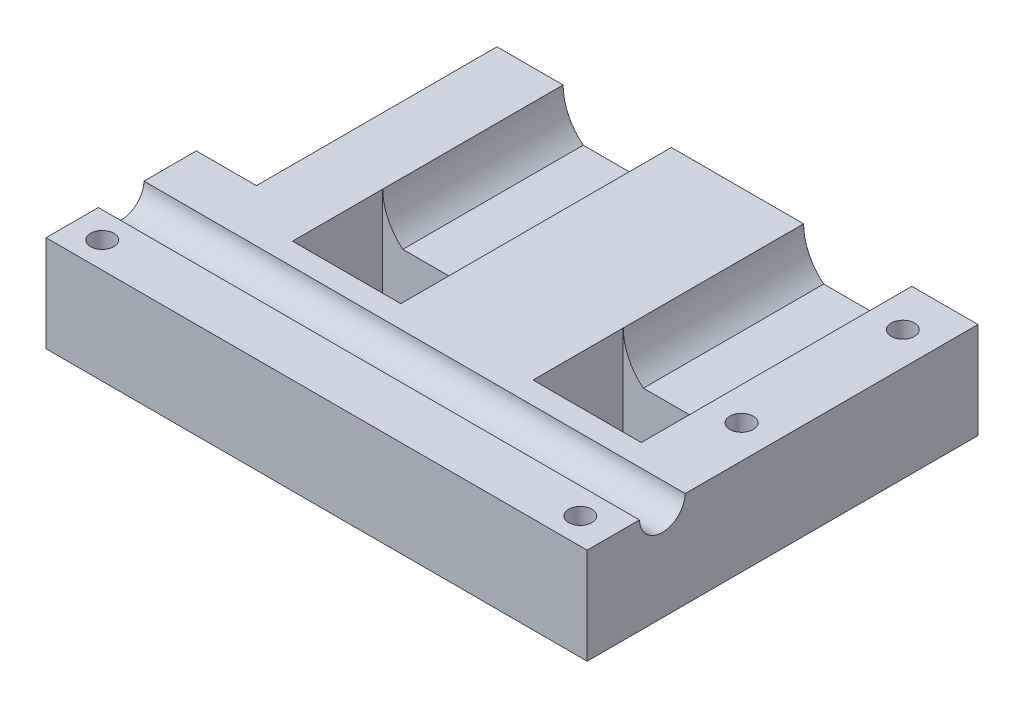
ISO-10303-21;
HEADER;
FILE_DESCRIPTION(('STEP AP214'),'2;1');
FILE_NAME('part.step','',(''),(''),'','','');
FILE_SCHEMA(('AUTOMOTIVE_DESIGN { 1 0 10303 214 1 1 1 1 }'));
ENDSEC;
DATA;
#1=APPLICATION_CONTEXT('core data for automotive mechanical design processes');
#2=APPLICATION_PROTOCOL_DEFINITION('international standard','automotive_design',2000,#1);
#3=PRODUCT_CONTEXT('',#1,'mechanical');
#4=PRODUCT('Part','Part','',(#3));
#5=PRODUCT_RELATED_PRODUCT_CATEGORY('part','',(#4));
#6=PRODUCT_DEFINITION_FORMATION('','',#4);
#7=PRODUCT_DEFINITION_CONTEXT('part definition',#1,'design');
#8=PRODUCT_DEFINITION('design','',#6,#7);
#9=PRODUCT_DEFINITION_SHAPE('','',#8);
#10=(LENGTH_UNIT() NAMED_UNIT(*) SI_UNIT(.MILLI.,.METRE.));
#11=(NAMED_UNIT(*) PLANE_ANGLE_UNIT() SI_UNIT($,.RADIAN.));
#12=(NAMED_UNIT(*) SI_UNIT($,.STERADIAN.) SOLID_ANGLE_UNIT());
#13=UNCERTAINTY_MEASURE_WITH_UNIT(LENGTH_MEASURE(1.E-05),#10,'distance_accuracy_value','');
#14=(GEOMETRIC_REPRESENTATION_CONTEXT(3) GLOBAL_UNCERTAINTY_ASSIGNED_CONTEXT((#13)) GLOBAL_UNIT_ASSIGNED_CONTEXT((#10,
#11,#12)) REPRESENTATION_CONTEXT('',''));
#15=CARTESIAN_POINT('',(0.,0.,0.));
#16=DIRECTION('',(0.,0.,1.));
#17=DIRECTION('',(1.,0.,0.));
#18=AXIS2_PLACEMENT_3D('',#15,#16,#17);
#19=CARTESIAN_POINT('',(-50.8,20.32,38.1));
#20=DIRECTION('',(0.,-1.,0.));
#21=DIRECTION('',(1.,0.,0.));
#22=AXIS2_PLACEMENT_3D('',#19,#20,#21);
#23=PLANE('',#22);
#24=CARTESIAN_POINT('',(43.815,20.32,42.9573321644896));
#25=DIRECTION('',(0.,1.,0.));
#26=DIRECTION('',(0.,0.,1.));
#27=AXIS2_PLACEMENT_3D('',#24,#25,#26);
#28=CIRCLE('',#27,2.45745);
#29=CARTESIAN_POINT('',(43.815,20.32,45.4147821644896));
#30=VERTEX_POINT('',#29);
#31=EDGE_CURVE('E232',#30,#30,#28,.T.);
#32=ORIENTED_EDGE('',*,*,#31,.F.);
#33=EDGE_LOOP('',(#32));
#34=FACE_BOUND('',#33,.T.);
#35=DIRECTION('',(0.,0.,-1.));
#36=VECTOR('',#35,1.);
#37=CARTESIAN_POINT('',(-63.5,20.32,0.));
#38=LINE('',#37,#36);
#39=CARTESIAN_POINT('',(-63.5,20.32,61.8506713420415));
#40=VERTEX_POINT('',#39);
#41=CARTESIAN_POINT('',(-63.5,20.32,50.8));
#42=VERTEX_POINT('',#41);
#43=EDGE_CURVE('E210',#40,#42,#38,.T.);
#44=ORIENTED_EDGE('',*,*,#43,.F.);
#45=DIRECTION('',(-1.,0.,0.));
#46=VECTOR('',#45,1.);
#47=CARTESIAN_POINT('',(64.4499893040251,20.32,61.8506713420415));
#48=LINE('',#47,#46);
#49=CARTESIAN_POINT('',(50.8,20.32,61.8506713420415));
#50=VERTEX_POINT('',#49);
#51=EDGE_CURVE('E55',#40,#50,#48,.F.);
#52=ORIENTED_EDGE('',*,*,#51,.T.);
#53=DIRECTION('',(0.,0.,-1.));
#54=VECTOR('',#53,1.);
#55=CARTESIAN_POINT('',(50.8,20.32,38.1));
#56=LINE('',#55,#54);
#57=CARTESIAN_POINT('',(50.8,20.32,0.));
#58=VERTEX_POINT('',#57);
#59=EDGE_CURVE('E207',#50,#58,#56,.T.);
#60=ORIENTED_EDGE('',*,*,#59,.T.);
#61=DIRECTION('',(-1.,0.,0.));
#62=VECTOR('',#61,1.);
#63=CARTESIAN_POINT('',(50.8,20.32,0.));
#64=LINE('',#63,#62);
#65=CARTESIAN_POINT('',(36.83,20.32,0.));
#66=VERTEX_POINT('',#65);
#67=EDGE_CURVE('E359',#58,#66,#64,.T.);
#68=ORIENTED_EDGE('',*,*,#67,.T.);
#69=DIRECTION('',(0.,0.,-1.));
#70=VECTOR('',#69,1.);
#71=CARTESIAN_POINT('',(36.83,20.32,38.1));
#72=LINE('',#71,#70);
#73=CARTESIAN_POINT('',(36.83,20.32,38.1));
#74=VERTEX_POINT('',#73);
#75=EDGE_CURVE('E216',#74,#66,#72,.T.);
#76=ORIENTED_EDGE('',*,*,#75,.F.);
#77=DIRECTION('',(0.,0.,-1.));
#78=VECTOR('',#77,1.);
#79=CARTESIAN_POINT('',(36.83,20.32,38.1));
#80=LINE('',#79,#78);
#81=CARTESIAN_POINT('',(36.83,20.32,57.15));
#82=VERTEX_POINT('',#81);
#83=EDGE_CURVE('E294',#82,#74,#80,.T.);
#84=ORIENTED_EDGE('',*,*,#83,.F.);
#85=DIRECTION('',(1.,0.,0.));
#86=VECTOR('',#85,1.);
#87=CARTESIAN_POINT('',(36.83,20.32,57.15));
#88=LINE('',#87,#86);
#89=CARTESIAN_POINT('',(13.97,20.32,57.15));
#90=VERTEX_POINT('',#89);
#91=EDGE_CURVE('E291',#90,#82,#88,.T.);
#92=ORIENTED_EDGE('',*,*,#91,.F.);
#93=DIRECTION('',(0.,0.,1.));
#94=VECTOR('',#93,1.);
#95=CARTESIAN_POINT('',(13.97,20.32,38.1));
#96=LINE('',#95,#94);
#97=CARTESIAN_POINT('',(13.97,20.32,38.1));
#98=VERTEX_POINT('',#97);
#99=EDGE_CURVE('E254',#98,#90,#96,.T.);
#100=ORIENTED_EDGE('',*,*,#99,.F.);
#101=DIRECTION('',(0.,0.,-1.));
#102=VECTOR('',#101,1.);
#103=CARTESIAN_POINT('',(13.97,20.32,38.1));
#104=LINE('',#103,#102);
#105=CARTESIAN_POINT('',(13.97,20.32,0.));
#106=VERTEX_POINT('',#105);
#107=EDGE_CURVE('E397',#98,#106,#104,.T.);
#108=ORIENTED_EDGE('',*,*,#107,.T.);
#109=DIRECTION('',(-1.,0.,0.));
#110=VECTOR('',#109,1.);
#111=CARTESIAN_POINT('',(13.97,20.32,0.));
#112=LINE('',#111,#110);
#113=CARTESIAN_POINT('',(-13.97,20.32,0.));
#114=VERTEX_POINT('',#113);
#115=EDGE_CURVE('E367',#106,#114,#112,.T.);
#116=ORIENTED_EDGE('',*,*,#115,.T.);
#117=DIRECTION('',(0.,0.,-1.));
#118=VECTOR('',#117,1.);
#119=CARTESIAN_POINT('',(-13.97,20.32,38.1));
#120=LINE('',#119,#118);
#121=CARTESIAN_POINT('',(-13.97,20.32,38.1));
#122=VERTEX_POINT('',#121);
#123=EDGE_CURVE('E394',#122,#114,#120,.T.);
#124=ORIENTED_EDGE('',*,*,#123,.F.);
#125=DIRECTION('',(0.,0.,-1.));
#126=VECTOR('',#125,1.);
#127=CARTESIAN_POINT('',(-13.97,20.32,38.1));
#128=LINE('',#127,#126);
#129=CARTESIAN_POINT('',(-13.97,20.32,57.15));
#130=VERTEX_POINT('',#129);
#131=EDGE_CURVE('E269',#130,#122,#128,.T.);
#132=ORIENTED_EDGE('',*,*,#131,.F.);
#133=DIRECTION('',(1.,0.,0.));
#134=VECTOR('',#133,1.);
#135=CARTESIAN_POINT('',(-36.83,20.32,57.15));
#136=LINE('',#135,#134);
#137=CARTESIAN_POINT('',(-36.83,20.32,57.15));
#138=VERTEX_POINT('',#137);
#139=EDGE_CURVE('E265',#138,#130,#136,.T.);
#140=ORIENTED_EDGE('',*,*,#139,.F.);
#141=DIRECTION('',(0.,0.,1.));
#142=VECTOR('',#141,1.);
#143=CARTESIAN_POINT('',(-36.83,20.32,38.1));
#144=LINE('',#143,#142);
#145=CARTESIAN_POINT('',(-36.83,20.32,38.1));
#146=VERTEX_POINT('',#145);
#147=EDGE_CURVE('E63',#146,#138,#144,.T.);
#148=ORIENTED_EDGE('',*,*,#147,.F.);
#149=DIRECTION('',(0.,0.,-1.));
#150=VECTOR('',#149,1.);
#151=CARTESIAN_POINT('',(-36.83,20.32,38.1));
#152=LINE('',#151,#150);
#153=CARTESIAN_POINT('',(-36.83,20.32,0.));
#154=VERTEX_POINT('',#153);
#155=EDGE_CURVE('E385',#146,#154,#152,.T.);
#156=ORIENTED_EDGE('',*,*,#155,.T.);
#157=DIRECTION('',(-1.,0.,0.));
#158=VECTOR('',#157,1.);
#159=CARTESIAN_POINT('',(-50.8,20.32,0.));
#160=LINE('',#159,#158);
#161=CARTESIAN_POINT('',(-50.8,20.32,0.));
#162=VERTEX_POINT('',#161);
#163=EDGE_CURVE('E375',#154,#162,#160,.T.);
#164=ORIENTED_EDGE('',*,*,#163,.T.);
#165=DIRECTION('',(0.,0.,-1.));
#166=VECTOR('',#165,1.);
#167=CARTESIAN_POINT('',(-50.8,20.32,38.1));
#168=LINE('',#167,#166);
#169=CARTESIAN_POINT('',(-50.8,20.32,50.8));
#170=VERTEX_POINT('',#169);
#171=EDGE_CURVE('E383',#170,#162,#168,.T.);
#172=ORIENTED_EDGE('',*,*,#171,.F.);
#173=DIRECTION('',(1.,0.,0.));
#174=VECTOR('',#173,1.);
#175=CARTESIAN_POINT('',(-63.5,20.32,50.8));
#176=LINE('',#175,#174);
#177=EDGE_CURVE('E324',#42,#170,#176,.T.);
#178=ORIENTED_EDGE('',*,*,#177,.F.);
#179=EDGE_LOOP('',(#44,#52,#60,#68,#76,#84,#92,#100,#108,#116,#124,#132,#140,#148,#156,#164,
#172,#178));
#180=FACE_BOUND('',#179,.T.);
#181=CARTESIAN_POINT('',(43.815,20.32,8.89));
#182=DIRECTION('',(0.,1.,0.));
#183=DIRECTION('',(0.,0.,1.));
#184=AXIS2_PLACEMENT_3D('',#181,#182,#183);
#185=CIRCLE('',#184,2.45745);
#186=CARTESIAN_POINT('',(43.815,20.32,11.34745));
#187=VERTEX_POINT('',#186);
#188=EDGE_CURVE('E246',#187,#187,#185,.T.);
#189=ORIENTED_EDGE('',*,*,#188,.F.);
#190=EDGE_LOOP('',(#189));
#191=FACE_BOUND('',#190,.T.);
#192=ADVANCED_FACE('F39',(#34,#180,#191),#23,.F.);
#193=CARTESIAN_POINT('',(43.815,20.32,77.0246643289793));
#194=DIRECTION('',(0.,1.,0.));
#195=DIRECTION('',(0.,0.,1.));
#196=AXIS2_PLACEMENT_3D('',#193,#194,#195);
#197=CIRCLE('',#196,2.45745);
#198=CARTESIAN_POINT('',(43.815,20.32,79.4821143289793));
#199=VERTEX_POINT('',#198);
#200=EDGE_CURVE('E830',#199,#199,#197,.T.);
#201=ORIENTED_EDGE('',*,*,#200,.F.);
#202=EDGE_LOOP('',(#201));
#203=FACE_BOUND('',#202,.T.);
#204=CARTESIAN_POINT('',(-57.15,20.32,77.0246643289793));
#205=DIRECTION('',(0.,1.,0.));
#206=DIRECTION('',(0.,0.,1.));
#207=AXIS2_PLACEMENT_3D('',#204,#205,#206);
#208=CIRCLE('',#207,2.45745);
#209=CARTESIAN_POINT('',(-57.15,20.32,79.4821143289793));
#210=VERTEX_POINT('',#209);
#211=EDGE_CURVE('E240',#210,#210,#208,.T.);
#212=ORIENTED_EDGE('',*,*,#211,.F.);
#213=EDGE_LOOP('',(#212));
#214=FACE_BOUND('',#213,.T.);
#215=CARTESIAN_POINT('',(50.8,20.32,82.55));
#216=VERTEX_POINT('',#215);
#217=CARTESIAN_POINT('',(50.8,20.32,71.4993286579585));
#218=VERTEX_POINT('',#217);
#219=EDGE_CURVE('E48',#216,#218,#56,.T.);
#220=ORIENTED_EDGE('',*,*,#219,.T.);
#221=DIRECTION('',(-1.,0.,0.));
#222=VECTOR('',#221,1.);
#223=CARTESIAN_POINT('',(64.4499893040251,20.32,71.4993286579585));
#224=LINE('',#223,#222);
#225=CARTESIAN_POINT('',(-63.5,20.32,71.4993286579585));
#226=VERTEX_POINT('',#225);
#227=EDGE_CURVE('E198',#218,#226,#224,.T.);
#228=ORIENTED_EDGE('',*,*,#227,.T.);
#229=CARTESIAN_POINT('',(-63.5,20.32,82.55));
#230=VERTEX_POINT('',#229);
#231=EDGE_CURVE('E321',#230,#226,#38,.T.);
#232=ORIENTED_EDGE('',*,*,#231,.F.);
#233=DIRECTION('',(-1.,0.,0.));
#234=VECTOR('',#233,1.);
#235=CARTESIAN_POINT('',(-50.8,20.32,82.55));
#236=LINE('',#235,#234);
#237=EDGE_CURVE('E341',#216,#230,#236,.T.);
#238=ORIENTED_EDGE('',*,*,#237,.F.);
#239=EDGE_LOOP('',(#220,#228,#232,#238));
#240=FACE_BOUND('',#239,.T.);
#241=ADVANCED_FACE('F449',(#203,#214,#240),#23,.F.);
#242=CARTESIAN_POINT('',(50.8,0.,38.1));
#243=DIRECTION('',(-1.,0.,0.));
#244=DIRECTION('',(0.,-1.,0.));
#245=AXIS2_PLACEMENT_3D('',#242,#243,#244);
#246=PLANE('',#245);
#247=ORIENTED_EDGE('',*,*,#59,.F.);
#248=CARTESIAN_POINT('',(50.8,20.447,66.675));
#249=DIRECTION('',(-1.,0.,0.));
#250=DIRECTION('',(0.,-1.,0.));
#251=AXIS2_PLACEMENT_3D('',#248,#249,#250);
#252=CIRCLE('',#251,4.826);
#253=EDGE_CURVE('E195',#218,#50,#252,.F.);
#254=ORIENTED_EDGE('',*,*,#253,.F.);
#255=ORIENTED_EDGE('',*,*,#219,.F.);
#256=DIRECTION('',(0.,1.,0.));
#257=VECTOR('',#256,1.);
#258=CARTESIAN_POINT('',(50.8,20.32,82.55));
#259=LINE('',#258,#257);
#260=CARTESIAN_POINT('',(50.8,0.,82.55));
#261=VERTEX_POINT('',#260);
#262=EDGE_CURVE('E338',#261,#216,#259,.T.);
#263=ORIENTED_EDGE('',*,*,#262,.F.);
#264=DIRECTION('',(0.,0.,-1.));
#265=VECTOR('',#264,1.);
#266=CARTESIAN_POINT('',(50.8,0.,38.1));
#267=LINE('',#266,#265);
#268=CARTESIAN_POINT('',(50.8,0.,0.));
#269=VERTEX_POINT('',#268);
#270=EDGE_CURVE('E357',#261,#269,#267,.T.);
#271=ORIENTED_EDGE('',*,*,#270,.T.);
#272=DIRECTION('',(0.,1.,0.));
#273=VECTOR('',#272,1.);
#274=CARTESIAN_POINT('',(50.8,0.,0.));
#275=LINE('',#274,#273);
#276=EDGE_CURVE('E215',#269,#58,#275,.T.);
#277=ORIENTED_EDGE('',*,*,#276,.T.);
#278=EDGE_LOOP('',(#247,#254,#255,#263,#271,#277));
#279=FACE_BOUND('',#278,.T.);
#280=ADVANCED_FACE('F41',(#279),#246,.F.);
#281=CARTESIAN_POINT('',(25.4,20.32,38.1));
#282=DIRECTION('',(0.,0.,-1.));
#283=DIRECTION('',(-1.,0.,0.));
#284=AXIS2_PLACEMENT_3D('',#281,#282,#283);
#285=CYLINDRICAL_SURFACE('',#284,11.43);
#286=CARTESIAN_POINT('',(25.4,20.32,0.));
#287=DIRECTION('',(0.,0.,-1.));
#288=DIRECTION('',(1.,0.,0.));
#289=AXIS2_PLACEMENT_3D('',#286,#287,#288);
#290=CIRCLE('',#289,11.43);
#291=CARTESIAN_POINT('',(32.5842048968553,11.43,0.));
#292=VERTEX_POINT('',#291);
#293=EDGE_CURVE('E361',#66,#292,#290,.T.);
#294=ORIENTED_EDGE('',*,*,#293,.T.);
#295=DIRECTION('',(0.,0.,-1.));
#296=VECTOR('',#295,1.);
#297=CARTESIAN_POINT('',(32.5842048968553,11.43,38.1));
#298=LINE('',#297,#296);
#299=CARTESIAN_POINT('',(32.5842048968553,11.43,38.1));
#300=VERTEX_POINT('',#299);
#301=EDGE_CURVE('E219',#300,#292,#298,.T.);
#302=ORIENTED_EDGE('',*,*,#301,.F.);
#303=CARTESIAN_POINT('',(25.4,20.32,38.1));
#304=DIRECTION('',(0.,0.,-1.));
#305=DIRECTION('',(1.,0.,0.));
#306=AXIS2_PLACEMENT_3D('',#303,#304,#305);
#307=CIRCLE('',#306,11.43);
#308=EDGE_CURVE('E343',#74,#300,#307,.T.);
#309=ORIENTED_EDGE('',*,*,#308,.F.);
#310=ORIENTED_EDGE('',*,*,#75,.T.);
#311=EDGE_LOOP('',(#294,#302,#309,#310));
#312=FACE_BOUND('',#311,.T.);
#313=ADVANCED_FACE('F433',(#312),#285,.F.);
#314=CARTESIAN_POINT('',(32.5842048968553,11.43,38.1));
#315=DIRECTION('',(0.,-1.,0.));
#316=DIRECTION('',(1.,0.,0.));
#317=AXIS2_PLACEMENT_3D('',#314,#315,#316);
#318=PLANE('',#317);
#319=DIRECTION('',(-1.,0.,0.));
#320=VECTOR('',#319,1.);
#321=CARTESIAN_POINT('',(32.5842048968553,11.43,0.));
#322=LINE('',#321,#320);
#323=CARTESIAN_POINT('',(18.2157951031447,11.43,0.));
#324=VERTEX_POINT('',#323);
#325=EDGE_CURVE('E363',#292,#324,#322,.T.);
#326=ORIENTED_EDGE('',*,*,#325,.T.);
#327=DIRECTION('',(0.,0.,-1.));
#328=VECTOR('',#327,1.);
#329=CARTESIAN_POINT('',(18.2157951031447,11.43,38.1));
#330=LINE('',#329,#328);
#331=CARTESIAN_POINT('',(18.2157951031447,11.43,38.1));
#332=VERTEX_POINT('',#331);
#333=EDGE_CURVE('E400',#332,#324,#330,.T.);
#334=ORIENTED_EDGE('',*,*,#333,.F.);
#335=DIRECTION('',(-1.,0.,0.));
#336=VECTOR('',#335,1.);
#337=CARTESIAN_POINT('',(32.5842048968553,11.43,38.1));
#338=LINE('',#337,#336);
#339=EDGE_CURVE('E345',#300,#332,#338,.T.);
#340=ORIENTED_EDGE('',*,*,#339,.F.);
#341=ORIENTED_EDGE('',*,*,#301,.T.);
#342=EDGE_LOOP('',(#326,#334,#340,#341));
#343=FACE_BOUND('',#342,.T.);
#344=ADVANCED_FACE('F407',(#343),#318,.F.);
#345=CARTESIAN_POINT('',(25.4,20.32,38.1));
#346=DIRECTION('',(0.,0.,-1.));
#347=DIRECTION('',(-1.,0.,0.));
#348=AXIS2_PLACEMENT_3D('',#345,#346,#347);
#349=CYLINDRICAL_SURFACE('',#348,11.43);
#350=CARTESIAN_POINT('',(25.4,20.32,0.));
#351=DIRECTION('',(0.,0.,-1.));
#352=DIRECTION('',(1.,0.,0.));
#353=AXIS2_PLACEMENT_3D('',#350,#351,#352);
#354=CIRCLE('',#353,11.43);
#355=EDGE_CURVE('E365',#324,#106,#354,.T.);
#356=ORIENTED_EDGE('',*,*,#355,.T.);
#357=ORIENTED_EDGE('',*,*,#107,.F.);
#358=CARTESIAN_POINT('',(25.4,20.32,38.1));
#359=DIRECTION('',(0.,0.,-1.));
#360=DIRECTION('',(1.,0.,0.));
#361=AXIS2_PLACEMENT_3D('',#358,#359,#360);
#362=CIRCLE('',#361,11.43);
#363=EDGE_CURVE('E348',#332,#98,#362,.T.);
#364=ORIENTED_EDGE('',*,*,#363,.F.);
#365=ORIENTED_EDGE('',*,*,#333,.T.);
#366=EDGE_LOOP('',(#356,#357,#364,#365));
#367=FACE_BOUND('',#366,.T.);
#368=ADVANCED_FACE('F419',(#367),#349,.F.);
#369=CARTESIAN_POINT('',(-25.4,20.32,38.1));
#370=DIRECTION('',(0.,0.,-1.));
#371=DIRECTION('',(-1.,0.,0.));
#372=AXIS2_PLACEMENT_3D('',#369,#370,#371);
#373=CYLINDRICAL_SURFACE('',#372,11.43);
#374=CARTESIAN_POINT('',(-25.4,20.32,0.));
#375=DIRECTION('',(0.,0.,-1.));
#376=DIRECTION('',(-1.,0.,0.));
#377=AXIS2_PLACEMENT_3D('',#374,#375,#376);
#378=CIRCLE('',#377,11.43);
#379=CARTESIAN_POINT('',(-18.2157951031447,11.43,0.));
#380=VERTEX_POINT('',#379);
#381=EDGE_CURVE('E369',#114,#380,#378,.T.);
#382=ORIENTED_EDGE('',*,*,#381,.T.);
#383=DIRECTION('',(0.,0.,-1.));
#384=VECTOR('',#383,1.);
#385=CARTESIAN_POINT('',(-18.2157951031447,11.43,38.1));
#386=LINE('',#385,#384);
#387=CARTESIAN_POINT('',(-18.2157951031447,11.43,38.1));
#388=VERTEX_POINT('',#387);
#389=EDGE_CURVE('E391',#388,#380,#386,.T.);
#390=ORIENTED_EDGE('',*,*,#389,.F.);
#391=CARTESIAN_POINT('',(-25.4,20.32,38.1));
#392=DIRECTION('',(0.,0.,-1.));
#393=DIRECTION('',(-1.,0.,0.));
#394=AXIS2_PLACEMENT_3D('',#391,#392,#393);
#395=CIRCLE('',#394,11.43);
#396=EDGE_CURVE('E351',#122,#388,#395,.T.);
#397=ORIENTED_EDGE('',*,*,#396,.F.);
#398=ORIENTED_EDGE('',*,*,#123,.T.);
#399=EDGE_LOOP('',(#382,#390,#397,#398));
#400=FACE_BOUND('',#399,.T.);
#401=ADVANCED_FACE('F474',(#400),#373,.F.);
#402=CARTESIAN_POINT('',(-32.5842048968553,11.43,38.1));
#403=DIRECTION('',(0.,-1.,0.));
#404=DIRECTION('',(1.,0.,0.));
#405=AXIS2_PLACEMENT_3D('',#402,#403,#404);
#406=PLANE('',#405);
#407=DIRECTION('',(-1.,0.,0.));
#408=VECTOR('',#407,1.);
#409=CARTESIAN_POINT('',(-32.5842048968553,11.43,0.));
#410=LINE('',#409,#408);
#411=CARTESIAN_POINT('',(-32.5842048968553,11.43,0.));
#412=VERTEX_POINT('',#411);
#413=EDGE_CURVE('E371',#380,#412,#410,.T.);
#414=ORIENTED_EDGE('',*,*,#413,.T.);
#415=DIRECTION('',(0.,0.,-1.));
#416=VECTOR('',#415,1.);
#417=CARTESIAN_POINT('',(-32.5842048968553,11.43,38.1));
#418=LINE('',#417,#416);
#419=CARTESIAN_POINT('',(-32.5842048968553,11.43,38.1));
#420=VERTEX_POINT('',#419);
#421=EDGE_CURVE('E388',#420,#412,#418,.T.);
#422=ORIENTED_EDGE('',*,*,#421,.F.);
#423=DIRECTION('',(-1.,0.,0.));
#424=VECTOR('',#423,1.);
#425=CARTESIAN_POINT('',(-32.5842048968553,11.43,38.1));
#426=LINE('',#425,#424);
#427=EDGE_CURVE('E353',#388,#420,#426,.T.);
#428=ORIENTED_EDGE('',*,*,#427,.F.);
#429=ORIENTED_EDGE('',*,*,#389,.T.);
#430=EDGE_LOOP('',(#414,#422,#428,#429));
#431=FACE_BOUND('',#430,.T.);
#432=ADVANCED_FACE('F471',(#431),#406,.F.);
#433=CARTESIAN_POINT('',(-25.4,20.32,38.1));
#434=DIRECTION('',(0.,0.,-1.));
#435=DIRECTION('',(-1.,0.,0.));
#436=AXIS2_PLACEMENT_3D('',#433,#434,#435);
#437=CYLINDRICAL_SURFACE('',#436,11.43);
#438=CARTESIAN_POINT('',(-25.4,20.32,0.));
#439=DIRECTION('',(0.,0.,-1.));
#440=DIRECTION('',(-1.,0.,0.));
#441=AXIS2_PLACEMENT_3D('',#438,#439,#440);
#442=CIRCLE('',#441,11.43);
#443=EDGE_CURVE('E373',#412,#154,#442,.T.);
#444=ORIENTED_EDGE('',*,*,#443,.T.);
#445=ORIENTED_EDGE('',*,*,#155,.F.);
#446=CARTESIAN_POINT('',(-25.4,20.32,38.1));
#447=DIRECTION('',(0.,0.,-1.));
#448=DIRECTION('',(-1.,0.,0.));
#449=AXIS2_PLACEMENT_3D('',#446,#447,#448);
#450=CIRCLE('',#449,11.43);
#451=EDGE_CURVE('E355',#420,#146,#450,.T.);
#452=ORIENTED_EDGE('',*,*,#451,.F.);
#453=ORIENTED_EDGE('',*,*,#421,.T.);
#454=EDGE_LOOP('',(#444,#445,#452,#453));
#455=FACE_BOUND('',#454,.T.);
#456=ADVANCED_FACE('F467',(#455),#437,.F.);
#457=CARTESIAN_POINT('',(-50.8,0.,38.1));
#458=DIRECTION('',(1.,0.,0.));
#459=DIRECTION('',(0.,1.,0.));
#460=AXIS2_PLACEMENT_3D('',#457,#458,#459);
#461=PLANE('',#460);
#462=DIRECTION('',(0.,0.,1.));
#463=VECTOR('',#462,1.);
#464=CARTESIAN_POINT('',(-50.8,7.11199999999998,0.));
#465=LINE('',#464,#463);
#466=CARTESIAN_POINT('',(-50.8,7.11199999999998,0.));
#467=VERTEX_POINT('',#466);
#468=CARTESIAN_POINT('',(-50.8,7.11199999999998,50.8));
#469=VERTEX_POINT('',#468);
#470=EDGE_CURVE('E309',#467,#469,#465,.T.);
#471=ORIENTED_EDGE('',*,*,#470,.T.);
#472=DIRECTION('',(0.,1.,0.));
#473=VECTOR('',#472,1.);
#474=CARTESIAN_POINT('',(-50.8,0.,50.8));
#475=LINE('',#474,#473);
#476=EDGE_CURVE('E280',#469,#170,#475,.T.);
#477=ORIENTED_EDGE('',*,*,#476,.T.);
#478=ORIENTED_EDGE('',*,*,#171,.T.);
#479=DIRECTION('',(0.,-1.,0.));
#480=VECTOR('',#479,1.);
#481=CARTESIAN_POINT('',(-50.8,0.,0.));
#482=LINE('',#481,#480);
#483=EDGE_CURVE('E378',#162,#467,#482,.T.);
#484=ORIENTED_EDGE('',*,*,#483,.T.);
#485=EDGE_LOOP('',(#471,#477,#478,#484));
#486=FACE_BOUND('',#485,.T.);
#487=ADVANCED_FACE('F458',(#486),#461,.F.);
#488=CARTESIAN_POINT('',(-50.8,0.,38.1));
#489=DIRECTION('',(0.,1.,0.));
#490=DIRECTION('',(0.,0.,1.));
#491=AXIS2_PLACEMENT_3D('',#488,#489,#490);
#492=PLANE('',#491);
#493=CARTESIAN_POINT('',(43.815,0.,77.0246643289793));
#494=DIRECTION('',(0.,1.,0.));
#495=DIRECTION('',(0.,0.,1.));
#496=AXIS2_PLACEMENT_3D('',#493,#494,#495);
#497=CIRCLE('',#496,2.45745);
#498=CARTESIAN_POINT('',(43.815,0.,79.4821143289793));
#499=VERTEX_POINT('',#498);
#500=EDGE_CURVE('E833',#499,#499,#497,.T.);
#501=ORIENTED_EDGE('',*,*,#500,.T.);
#502=EDGE_LOOP('',(#501));
#503=FACE_BOUND('',#502,.T.);
#504=CARTESIAN_POINT('',(-57.15,0.,77.0246643289793));
#505=DIRECTION('',(0.,1.,0.));
#506=DIRECTION('',(0.,0.,1.));
#507=AXIS2_PLACEMENT_3D('',#504,#505,#506);
#508=CIRCLE('',#507,2.45745);
#509=CARTESIAN_POINT('',(-57.15,0.,79.4821143289793));
#510=VERTEX_POINT('',#509);
#511=EDGE_CURVE('E43',#510,#510,#508,.T.);
#512=ORIENTED_EDGE('',*,*,#511,.T.);
#513=EDGE_LOOP('',(#512));
#514=FACE_BOUND('',#513,.T.);
#515=CARTESIAN_POINT('',(43.815,0.,42.9573321644896));
#516=DIRECTION('',(0.,1.,0.));
#517=DIRECTION('',(0.,0.,1.));
#518=AXIS2_PLACEMENT_3D('',#515,#516,#517);
#519=CIRCLE('',#518,2.45745);
#520=CARTESIAN_POINT('',(43.815,0.,45.4147821644896));
#521=VERTEX_POINT('',#520);
#522=EDGE_CURVE('E230',#521,#521,#519,.T.);
#523=ORIENTED_EDGE('',*,*,#522,.T.);
#524=EDGE_LOOP('',(#523));
#525=FACE_BOUND('',#524,.T.);
#526=CARTESIAN_POINT('',(-57.15,0.,42.9573321644896));
#527=DIRECTION('',(0.,1.,0.));
#528=DIRECTION('',(0.,0.,1.));
#529=AXIS2_PLACEMENT_3D('',#526,#527,#528);
#530=CIRCLE('',#529,2.45745);
#531=CARTESIAN_POINT('',(-57.15,0.,45.4147821644896));
#532=VERTEX_POINT('',#531);
#533=EDGE_CURVE('E229',#532,#532,#530,.T.);
#534=ORIENTED_EDGE('',*,*,#533,.T.);
#535=EDGE_LOOP('',(#534));
#536=FACE_BOUND('',#535,.T.);
#537=CARTESIAN_POINT('',(43.815,0.,8.89));
#538=DIRECTION('',(0.,1.,0.));
#539=DIRECTION('',(0.,0.,1.));
#540=AXIS2_PLACEMENT_3D('',#537,#538,#539);
#541=CIRCLE('',#540,2.45745);
#542=CARTESIAN_POINT('',(43.815,0.,11.34745));
#543=VERTEX_POINT('',#542);
#544=EDGE_CURVE('E202',#543,#543,#541,.T.);
#545=ORIENTED_EDGE('',*,*,#544,.T.);
#546=EDGE_LOOP('',(#545));
#547=FACE_BOUND('',#546,.T.);
#548=CARTESIAN_POINT('',(-57.15,0.,8.89));
#549=DIRECTION('',(0.,1.,0.));
#550=DIRECTION('',(0.,0.,1.));
#551=AXIS2_PLACEMENT_3D('',#548,#549,#550);
#552=CIRCLE('',#551,2.45745);
#553=CARTESIAN_POINT('',(-57.15,0.,11.34745));
#554=VERTEX_POINT('',#553);
#555=EDGE_CURVE('E223',#554,#554,#552,.T.);
#556=ORIENTED_EDGE('',*,*,#555,.T.);
#557=EDGE_LOOP('',(#556));
#558=FACE_BOUND('',#557,.T.);
#559=DIRECTION('',(1.,0.,0.));
#560=VECTOR('',#559,1.);
#561=CARTESIAN_POINT('',(-36.83,0.,38.1));
#562=LINE('',#561,#560);
#563=CARTESIAN_POINT('',(-36.83,0.,38.1));
#564=VERTEX_POINT('',#563);
#565=CARTESIAN_POINT('',(-13.97,0.,38.1));
#566=VERTEX_POINT('',#565);
#567=EDGE_CURVE('E258',#564,#566,#562,.T.);
#568=ORIENTED_EDGE('',*,*,#567,.F.);
#569=DIRECTION('',(0.,0.,-1.));
#570=VECTOR('',#569,1.);
#571=CARTESIAN_POINT('',(-36.83,0.,38.1));
#572=LINE('',#571,#570);
#573=CARTESIAN_POINT('',(-36.83,0.,57.15));
#574=VERTEX_POINT('',#573);
#575=EDGE_CURVE('E261',#574,#564,#572,.T.);
#576=ORIENTED_EDGE('',*,*,#575,.F.);
#577=DIRECTION('',(-1.,0.,0.));
#578=VECTOR('',#577,1.);
#579=CARTESIAN_POINT('',(-36.83,0.,57.15));
#580=LINE('',#579,#578);
#581=CARTESIAN_POINT('',(-13.97,0.,57.15));
#582=VERTEX_POINT('',#581);
#583=EDGE_CURVE('E263',#582,#574,#580,.T.);
#584=ORIENTED_EDGE('',*,*,#583,.F.);
#585=DIRECTION('',(0.,0.,1.));
#586=VECTOR('',#585,1.);
#587=CARTESIAN_POINT('',(-13.97,0.,38.1));
#588=LINE('',#587,#586);
#589=EDGE_CURVE('E255',#566,#582,#588,.T.);
#590=ORIENTED_EDGE('',*,*,#589,.F.);
#591=EDGE_LOOP('',(#568,#576,#584,#590));
#592=FACE_BOUND('',#591,.T.);
#593=DIRECTION('',(0.,0.,1.));
#594=VECTOR('',#593,1.);
#595=CARTESIAN_POINT('',(36.83,0.,38.1));
#596=LINE('',#595,#594);
#597=CARTESIAN_POINT('',(36.83,0.,38.1));
#598=VERTEX_POINT('',#597);
#599=CARTESIAN_POINT('',(36.83,0.,57.15));
#600=VERTEX_POINT('',#599);
#601=EDGE_CURVE('E284',#598,#600,#596,.T.);
#602=ORIENTED_EDGE('',*,*,#601,.F.);
#603=DIRECTION('',(1.,0.,0.));
#604=VECTOR('',#603,1.);
#605=CARTESIAN_POINT('',(36.83,0.,38.1));
#606=LINE('',#605,#604);
#607=CARTESIAN_POINT('',(13.97,0.,38.1));
#608=VERTEX_POINT('',#607);
#609=EDGE_CURVE('E287',#608,#598,#606,.T.);
#610=ORIENTED_EDGE('',*,*,#609,.F.);
#611=DIRECTION('',(0.,0.,-1.));
#612=VECTOR('',#611,1.);
#613=CARTESIAN_POINT('',(13.97,0.,38.1));
#614=LINE('',#613,#612);
#615=CARTESIAN_POINT('',(13.97,0.,57.15));
#616=VERTEX_POINT('',#615);
#617=EDGE_CURVE('E266',#616,#608,#614,.T.);
#618=ORIENTED_EDGE('',*,*,#617,.F.);
#619=DIRECTION('',(-1.,0.,0.));
#620=VECTOR('',#619,1.);
#621=CARTESIAN_POINT('',(36.83,0.,57.15));
#622=LINE('',#621,#620);
#623=EDGE_CURVE('E281',#600,#616,#622,.T.);
#624=ORIENTED_EDGE('',*,*,#623,.F.);
#625=EDGE_LOOP('',(#602,#610,#618,#624));
#626=FACE_BOUND('',#625,.T.);
#627=DIRECTION('',(1.,0.,0.));
#628=VECTOR('',#627,1.);
#629=CARTESIAN_POINT('',(-50.8,0.,0.));
#630=LINE('',#629,#628);
#631=CARTESIAN_POINT('',(-63.5,0.,0.));
#632=VERTEX_POINT('',#631);
#633=EDGE_CURVE('E346',#632,#269,#630,.T.);
#634=ORIENTED_EDGE('',*,*,#633,.T.);
#635=ORIENTED_EDGE('',*,*,#270,.F.);
#636=DIRECTION('',(1.,0.,0.));
#637=VECTOR('',#636,1.);
#638=CARTESIAN_POINT('',(-50.8,0.,82.55));
#639=LINE('',#638,#637);
#640=CARTESIAN_POINT('',(-63.5,0.,82.55));
#641=VERTEX_POINT('',#640);
#642=EDGE_CURVE('E335',#641,#261,#639,.T.);
#643=ORIENTED_EDGE('',*,*,#642,.F.);
#644=DIRECTION('',(0.,0.,1.));
#645=VECTOR('',#644,1.);
#646=CARTESIAN_POINT('',(-63.5,0.,0.));
#647=LINE('',#646,#645);
#648=EDGE_CURVE('E315',#632,#641,#647,.T.);
#649=ORIENTED_EDGE('',*,*,#648,.F.);
#650=EDGE_LOOP('',(#634,#635,#643,#649));
#651=FACE_BOUND('',#650,.T.);
#652=ADVANCED_FACE('F443',(#503,#514,#525,#536,#547,#558,#592,#626,#651),#492,.F.);
#653=CARTESIAN_POINT('',(25.4,20.32,0.));
#654=DIRECTION('',(0.,0.,1.));
#655=DIRECTION('',(1.,0.,0.));
#656=AXIS2_PLACEMENT_3D('',#653,#654,#655);
#657=PLANE('',#656);
#658=ORIENTED_EDGE('',*,*,#276,.F.);
#659=ORIENTED_EDGE('',*,*,#633,.F.);
#660=DIRECTION('',(0.,-1.,0.));
#661=VECTOR('',#660,1.);
#662=CARTESIAN_POINT('',(-63.5,0.,0.));
#663=LINE('',#662,#661);
#664=CARTESIAN_POINT('',(-63.5,7.11199999999998,0.));
#665=VERTEX_POINT('',#664);
#666=EDGE_CURVE('E312',#665,#632,#663,.T.);
#667=ORIENTED_EDGE('',*,*,#666,.F.);
#668=DIRECTION('',(1.,0.,0.));
#669=VECTOR('',#668,1.);
#670=CARTESIAN_POINT('',(-63.5,7.11199999999998,0.));
#671=LINE('',#670,#669);
#672=EDGE_CURVE('E330',#665,#467,#671,.T.);
#673=ORIENTED_EDGE('',*,*,#672,.T.);
#674=ORIENTED_EDGE('',*,*,#483,.F.);
#675=ORIENTED_EDGE('',*,*,#163,.F.);
#676=ORIENTED_EDGE('',*,*,#443,.F.);
#677=ORIENTED_EDGE('',*,*,#413,.F.);
#678=ORIENTED_EDGE('',*,*,#381,.F.);
#679=ORIENTED_EDGE('',*,*,#115,.F.);
#680=ORIENTED_EDGE('',*,*,#355,.F.);
#681=ORIENTED_EDGE('',*,*,#325,.F.);
#682=ORIENTED_EDGE('',*,*,#293,.F.);
#683=ORIENTED_EDGE('',*,*,#67,.F.);
#684=EDGE_LOOP('',(#658,#659,#667,#673,#674,#675,#676,#677,#678,#679,#680,#681,#682,#683));
#685=FACE_BOUND('',#684,.T.);
#686=ADVANCED_FACE('F414',(#685),#657,.F.);
#687=CARTESIAN_POINT('',(0.,0.,82.55));
#688=DIRECTION('',(0.,0.,1.));
#689=DIRECTION('',(1.,0.,0.));
#690=AXIS2_PLACEMENT_3D('',#687,#688,#689);
#691=PLANE('',#690);
#692=ORIENTED_EDGE('',*,*,#237,.T.);
#693=DIRECTION('',(0.,1.,0.));
#694=VECTOR('',#693,1.);
#695=CARTESIAN_POINT('',(-63.5,0.,82.55));
#696=LINE('',#695,#694);
#697=EDGE_CURVE('E318',#641,#230,#696,.T.);
#698=ORIENTED_EDGE('',*,*,#697,.F.);
#699=ORIENTED_EDGE('',*,*,#642,.T.);
#700=ORIENTED_EDGE('',*,*,#262,.T.);
#701=EDGE_LOOP('',(#692,#698,#699,#700));
#702=FACE_BOUND('',#701,.T.);
#703=ADVANCED_FACE('F446',(#702),#691,.T.);
#704=CARTESIAN_POINT('',(-63.5,0.,50.8));
#705=DIRECTION('',(0.,0.,-1.));
#706=DIRECTION('',(-1.,0.,0.));
#707=AXIS2_PLACEMENT_3D('',#704,#705,#706);
#708=PLANE('',#707);
#709=ORIENTED_EDGE('',*,*,#476,.F.);
#710=DIRECTION('',(1.,0.,0.));
#711=VECTOR('',#710,1.);
#712=CARTESIAN_POINT('',(-63.5,7.11199999999998,50.8));
#713=LINE('',#712,#711);
#714=CARTESIAN_POINT('',(-63.5,7.11199999999998,50.8));
#715=VERTEX_POINT('',#714);
#716=EDGE_CURVE('E332',#715,#469,#713,.T.);
#717=ORIENTED_EDGE('',*,*,#716,.F.);
#718=DIRECTION('',(0.,1.,0.));
#719=VECTOR('',#718,1.);
#720=CARTESIAN_POINT('',(-63.5,0.,50.8));
#721=LINE('',#720,#719);
#722=EDGE_CURVE('E305',#715,#42,#721,.T.);
#723=ORIENTED_EDGE('',*,*,#722,.T.);
#724=ORIENTED_EDGE('',*,*,#177,.T.);
#725=EDGE_LOOP('',(#709,#717,#723,#724));
#726=FACE_BOUND('',#725,.T.);
#727=ADVANCED_FACE('F453',(#726),#708,.T.);
#728=CARTESIAN_POINT('',(-63.5,7.11199999999998,0.));
#729=DIRECTION('',(0.,1.,0.));
#730=DIRECTION('',(-1.,0.,0.));
#731=AXIS2_PLACEMENT_3D('',#728,#729,#730);
#732=PLANE('',#731);
#733=CARTESIAN_POINT('',(-57.15,7.11199999999998,42.9573321644896));
#734=DIRECTION('',(0.,1.,0.));
#735=DIRECTION('',(-1.,0.,0.));
#736=AXIS2_PLACEMENT_3D('',#733,#734,#735);
#737=CIRCLE('',#736,2.45745);
#738=CARTESIAN_POINT('',(-59.60745,7.11199999999998,42.9573321644896));
#739=VERTEX_POINT('',#738);
#740=EDGE_CURVE('E227',#739,#739,#737,.T.);
#741=ORIENTED_EDGE('',*,*,#740,.F.);
#742=EDGE_LOOP('',(#741));
#743=FACE_BOUND('',#742,.T.);
#744=CARTESIAN_POINT('',(-57.15,7.11199999999998,8.89));
#745=DIRECTION('',(0.,1.,0.));
#746=DIRECTION('',(-1.,0.,0.));
#747=AXIS2_PLACEMENT_3D('',#744,#745,#746);
#748=CIRCLE('',#747,2.45745);
#749=CARTESIAN_POINT('',(-59.60745,7.11199999999998,8.89));
#750=VERTEX_POINT('',#749);
#751=EDGE_CURVE('E225',#750,#750,#748,.T.);
#752=ORIENTED_EDGE('',*,*,#751,.F.);
#753=EDGE_LOOP('',(#752));
#754=FACE_BOUND('',#753,.T.);
#755=ORIENTED_EDGE('',*,*,#470,.F.);
#756=ORIENTED_EDGE('',*,*,#672,.F.);
#757=DIRECTION('',(0.,0.,1.));
#758=VECTOR('',#757,1.);
#759=CARTESIAN_POINT('',(-63.5,7.11199999999998,0.));
#760=LINE('',#759,#758);
#761=EDGE_CURVE('E308',#665,#715,#760,.T.);
#762=ORIENTED_EDGE('',*,*,#761,.T.);
#763=ORIENTED_EDGE('',*,*,#716,.T.);
#764=EDGE_LOOP('',(#755,#756,#762,#763));
#765=FACE_BOUND('',#764,.T.);
#766=ADVANCED_FACE('F456',(#743,#754,#765),#732,.T.);
#767=CARTESIAN_POINT('',(-63.5,0.,0.));
#768=DIRECTION('',(-1.,0.,0.));
#769=DIRECTION('',(0.,-1.,0.));
#770=AXIS2_PLACEMENT_3D('',#767,#768,#769);
#771=PLANE('',#770);
#772=CARTESIAN_POINT('',(-63.5,20.447,66.675));
#773=DIRECTION('',(-1.,0.,0.));
#774=DIRECTION('',(0.,-1.,0.));
#775=AXIS2_PLACEMENT_3D('',#772,#773,#774);
#776=CIRCLE('',#775,4.826);
#777=EDGE_CURVE('E11',#40,#226,#776,.T.);
#778=ORIENTED_EDGE('',*,*,#777,.F.);
#779=ORIENTED_EDGE('',*,*,#43,.T.);
#780=ORIENTED_EDGE('',*,*,#722,.F.);
#781=ORIENTED_EDGE('',*,*,#761,.F.);
#782=ORIENTED_EDGE('',*,*,#666,.T.);
#783=ORIENTED_EDGE('',*,*,#648,.T.);
#784=ORIENTED_EDGE('',*,*,#697,.T.);
#785=ORIENTED_EDGE('',*,*,#231,.T.);
#786=EDGE_LOOP('',(#778,#779,#780,#781,#782,#783,#784,#785));
#787=FACE_BOUND('',#786,.T.);
#788=ADVANCED_FACE('F440',(#787),#771,.T.);
#789=CARTESIAN_POINT('',(36.83,-29.7570512652044,38.1));
#790=DIRECTION('',(0.,0.,-1.));
#791=DIRECTION('',(-1.,0.,0.));
#792=AXIS2_PLACEMENT_3D('',#789,#790,#791);
#793=PLANE('',#792);
#794=ORIENTED_EDGE('',*,*,#339,.T.);
#795=ORIENTED_EDGE('',*,*,#363,.T.);
#796=DIRECTION('',(0.,1.,0.));
#797=VECTOR('',#796,1.);
#798=CARTESIAN_POINT('',(13.97,-29.7570512652044,38.1));
#799=LINE('',#798,#797);
#800=EDGE_CURVE('E297',#608,#98,#799,.T.);
#801=ORIENTED_EDGE('',*,*,#800,.F.);
#802=ORIENTED_EDGE('',*,*,#609,.T.);
#803=DIRECTION('',(0.,1.,0.));
#804=VECTOR('',#803,1.);
#805=CARTESIAN_POINT('',(36.83,-29.7570512652044,38.1));
#806=LINE('',#805,#804);
#807=EDGE_CURVE('E285',#598,#74,#806,.T.);
#808=ORIENTED_EDGE('',*,*,#807,.T.);
#809=ORIENTED_EDGE('',*,*,#308,.T.);
#810=EDGE_LOOP('',(#794,#795,#801,#802,#808,#809));
#811=FACE_BOUND('',#810,.T.);
#812=ADVANCED_FACE('F431',(#811),#793,.F.);
#813=CARTESIAN_POINT('',(36.83,-29.7570512652044,38.1));
#814=DIRECTION('',(1.,0.,0.));
#815=DIRECTION('',(0.,0.,-1.));
#816=AXIS2_PLACEMENT_3D('',#813,#814,#815);
#817=PLANE('',#816);
#818=ORIENTED_EDGE('',*,*,#601,.T.);
#819=DIRECTION('',(0.,1.,0.));
#820=VECTOR('',#819,1.);
#821=CARTESIAN_POINT('',(36.83,-29.7570512652044,57.15));
#822=LINE('',#821,#820);
#823=EDGE_CURVE('E299',#600,#82,#822,.T.);
#824=ORIENTED_EDGE('',*,*,#823,.T.);
#825=ORIENTED_EDGE('',*,*,#83,.T.);
#826=ORIENTED_EDGE('',*,*,#807,.F.);
#827=EDGE_LOOP('',(#818,#824,#825,#826));
#828=FACE_BOUND('',#827,.T.);
#829=ADVANCED_FACE('F636',(#828),#817,.F.);
#830=CARTESIAN_POINT('',(36.83,-29.7570512652044,57.15));
#831=DIRECTION('',(0.,0.,1.));
#832=DIRECTION('',(1.,0.,0.));
#833=AXIS2_PLACEMENT_3D('',#830,#831,#832);
#834=PLANE('',#833);
#835=ORIENTED_EDGE('',*,*,#623,.T.);
#836=DIRECTION('',(0.,1.,0.));
#837=VECTOR('',#836,1.);
#838=CARTESIAN_POINT('',(13.97,-29.7570512652044,57.15));
#839=LINE('',#838,#837);
#840=EDGE_CURVE('E301',#616,#90,#839,.T.);
#841=ORIENTED_EDGE('',*,*,#840,.T.);
#842=ORIENTED_EDGE('',*,*,#91,.T.);
#843=ORIENTED_EDGE('',*,*,#823,.F.);
#844=EDGE_LOOP('',(#835,#841,#842,#843));
#845=FACE_BOUND('',#844,.T.);
#846=ADVANCED_FACE('F499',(#845),#834,.F.);
#847=CARTESIAN_POINT('',(13.97,-29.7570512652044,38.1));
#848=DIRECTION('',(-1.,0.,0.));
#849=DIRECTION('',(0.,0.,1.));
#850=AXIS2_PLACEMENT_3D('',#847,#848,#849);
#851=PLANE('',#850);
#852=ORIENTED_EDGE('',*,*,#617,.T.);
#853=ORIENTED_EDGE('',*,*,#800,.T.);
#854=ORIENTED_EDGE('',*,*,#99,.T.);
#855=ORIENTED_EDGE('',*,*,#840,.F.);
#856=EDGE_LOOP('',(#852,#853,#854,#855));
#857=FACE_BOUND('',#856,.T.);
#858=ADVANCED_FACE('F426',(#857),#851,.F.);
#859=CARTESIAN_POINT('',(-36.83,-29.7570512652044,38.1));
#860=DIRECTION('',(0.,0.,-1.));
#861=DIRECTION('',(-1.,0.,0.));
#862=AXIS2_PLACEMENT_3D('',#859,#860,#861);
#863=PLANE('',#862);
#864=ORIENTED_EDGE('',*,*,#427,.T.);
#865=ORIENTED_EDGE('',*,*,#451,.T.);
#866=DIRECTION('',(0.,1.,0.));
#867=VECTOR('',#866,1.);
#868=CARTESIAN_POINT('',(-36.83,-29.7570512652044,38.1));
#869=LINE('',#868,#867);
#870=EDGE_CURVE('E259',#564,#146,#869,.T.);
#871=ORIENTED_EDGE('',*,*,#870,.F.);
#872=ORIENTED_EDGE('',*,*,#567,.T.);
#873=DIRECTION('',(0.,1.,0.));
#874=VECTOR('',#873,1.);
#875=CARTESIAN_POINT('',(-13.97,-29.7570512652044,38.1));
#876=LINE('',#875,#874);
#877=EDGE_CURVE('E274',#566,#122,#876,.T.);
#878=ORIENTED_EDGE('',*,*,#877,.T.);
#879=ORIENTED_EDGE('',*,*,#396,.T.);
#880=EDGE_LOOP('',(#864,#865,#871,#872,#878,#879));
#881=FACE_BOUND('',#880,.T.);
#882=ADVANCED_FACE('F491',(#881),#863,.F.);
#883=CARTESIAN_POINT('',(-36.83,-29.7570512652044,38.1));
#884=DIRECTION('',(-1.,0.,0.));
#885=DIRECTION('',(0.,0.,1.));
#886=AXIS2_PLACEMENT_3D('',#883,#884,#885);
#887=PLANE('',#886);
#888=ORIENTED_EDGE('',*,*,#575,.T.);
#889=ORIENTED_EDGE('',*,*,#870,.T.);
#890=ORIENTED_EDGE('',*,*,#147,.T.);
#891=DIRECTION('',(0.,1.,0.));
#892=VECTOR('',#891,1.);
#893=CARTESIAN_POINT('',(-36.83,-29.7570512652044,57.15));
#894=LINE('',#893,#892);
#895=EDGE_CURVE('E272',#574,#138,#894,.T.);
#896=ORIENTED_EDGE('',*,*,#895,.F.);
#897=EDGE_LOOP('',(#888,#889,#890,#896));
#898=FACE_BOUND('',#897,.T.);
#899=ADVANCED_FACE('F485',(#898),#887,.F.);
#900=CARTESIAN_POINT('',(-13.97,-29.7570512652044,38.1));
#901=DIRECTION('',(1.,0.,0.));
#902=DIRECTION('',(0.,0.,-1.));
#903=AXIS2_PLACEMENT_3D('',#900,#901,#902);
#904=PLANE('',#903);
#905=ORIENTED_EDGE('',*,*,#589,.T.);
#906=DIRECTION('',(0.,1.,0.));
#907=VECTOR('',#906,1.);
#908=CARTESIAN_POINT('',(-13.97,-29.7570512652044,57.15));
#909=LINE('',#908,#907);
#910=EDGE_CURVE('E276',#582,#130,#909,.T.);
#911=ORIENTED_EDGE('',*,*,#910,.T.);
#912=ORIENTED_EDGE('',*,*,#131,.T.);
#913=ORIENTED_EDGE('',*,*,#877,.F.);
#914=EDGE_LOOP('',(#905,#911,#912,#913));
#915=FACE_BOUND('',#914,.T.);
#916=ADVANCED_FACE('F479',(#915),#904,.F.);
#917=CARTESIAN_POINT('',(-36.83,-29.7570512652044,57.15));
#918=DIRECTION('',(0.,0.,1.));
#919=DIRECTION('',(1.,0.,0.));
#920=AXIS2_PLACEMENT_3D('',#917,#918,#919);
#921=PLANE('',#920);
#922=ORIENTED_EDGE('',*,*,#583,.T.);
#923=ORIENTED_EDGE('',*,*,#895,.T.);
#924=ORIENTED_EDGE('',*,*,#139,.T.);
#925=ORIENTED_EDGE('',*,*,#910,.F.);
#926=EDGE_LOOP('',(#922,#923,#924,#925));
#927=FACE_BOUND('',#926,.T.);
#928=ADVANCED_FACE('F483',(#927),#921,.F.);
#929=CARTESIAN_POINT('',(-57.15,20.32,8.89));
#930=DIRECTION('',(0.,1.,0.));
#931=DIRECTION('',(0.,0.,1.));
#932=AXIS2_PLACEMENT_3D('',#929,#930,#931);
#933=CYLINDRICAL_SURFACE('',#932,2.45745);
#934=ORIENTED_EDGE('',*,*,#751,.T.);
#935=EDGE_LOOP('',(#934));
#936=FACE_BOUND('',#935,.T.);
#937=ORIENTED_EDGE('',*,*,#555,.F.);
#938=EDGE_LOOP('',(#937));
#939=FACE_BOUND('',#938,.T.);
#940=ADVANCED_FACE('F621',(#936,#939),#933,.F.);
#941=CARTESIAN_POINT('',(64.4499893040251,20.447,66.675));
#942=DIRECTION('',(-1.,0.,0.));
#943=DIRECTION('',(0.,0.,1.));
#944=AXIS2_PLACEMENT_3D('',#941,#942,#943);
#945=CYLINDRICAL_SURFACE('',#944,4.826);
#946=ORIENTED_EDGE('',*,*,#253,.T.);
#947=ORIENTED_EDGE('',*,*,#51,.F.);
#948=ORIENTED_EDGE('',*,*,#777,.T.);
#949=ORIENTED_EDGE('',*,*,#227,.F.);
#950=EDGE_LOOP('',(#946,#947,#948,#949));
#951=FACE_BOUND('',#950,.T.);
#952=ADVANCED_FACE('F196',(#951),#945,.F.);
#953=CARTESIAN_POINT('',(43.815,20.32,8.89));
#954=DIRECTION('',(0.,1.,0.));
#955=DIRECTION('',(0.,0.,1.));
#956=AXIS2_PLACEMENT_3D('',#953,#954,#955);
#957=CYLINDRICAL_SURFACE('',#956,2.45745);
#958=ORIENTED_EDGE('',*,*,#188,.T.);
#959=EDGE_LOOP('',(#958));
#960=FACE_BOUND('',#959,.T.);
#961=ORIENTED_EDGE('',*,*,#544,.F.);
#962=EDGE_LOOP('',(#961));
#963=FACE_BOUND('',#962,.T.);
#964=ADVANCED_FACE('F569',(#960,#963),#957,.F.);
#965=CARTESIAN_POINT('',(-57.15,20.32,42.9573321644896));
#966=DIRECTION('',(0.,1.,0.));
#967=DIRECTION('',(0.,0.,1.));
#968=AXIS2_PLACEMENT_3D('',#965,#966,#967);
#969=CYLINDRICAL_SURFACE('',#968,2.45745);
#970=ORIENTED_EDGE('',*,*,#740,.T.);
#971=EDGE_LOOP('',(#970));
#972=FACE_BOUND('',#971,.T.);
#973=ORIENTED_EDGE('',*,*,#533,.F.);
#974=EDGE_LOOP('',(#973));
#975=FACE_BOUND('',#974,.T.);
#976=ADVANCED_FACE('F574',(#972,#975),#969,.F.);
#977=CARTESIAN_POINT('',(43.815,20.32,42.9573321644896));
#978=DIRECTION('',(0.,1.,0.));
#979=DIRECTION('',(0.,0.,1.));
#980=AXIS2_PLACEMENT_3D('',#977,#978,#979);
#981=CYLINDRICAL_SURFACE('',#980,2.45745);
#982=ORIENTED_EDGE('',*,*,#31,.T.);
#983=EDGE_LOOP('',(#982));
#984=FACE_BOUND('',#983,.T.);
#985=ORIENTED_EDGE('',*,*,#522,.F.);
#986=EDGE_LOOP('',(#985));
#987=FACE_BOUND('',#986,.T.);
#988=ADVANCED_FACE('F585',(#984,#987),#981,.F.);
#989=CARTESIAN_POINT('',(-57.15,20.32,77.0246643289793));
#990=DIRECTION('',(0.,1.,0.));
#991=DIRECTION('',(0.,0.,1.));
#992=AXIS2_PLACEMENT_3D('',#989,#990,#991);
#993=CYLINDRICAL_SURFACE('',#992,2.45745);
#994=ORIENTED_EDGE('',*,*,#211,.T.);
#995=EDGE_LOOP('',(#994));
#996=FACE_BOUND('',#995,.T.);
#997=ORIENTED_EDGE('',*,*,#511,.F.);
#998=EDGE_LOOP('',(#997));
#999=FACE_BOUND('',#998,.T.);
#1000=ADVANCED_FACE('F595',(#996,#999),#993,.F.);
#1001=CARTESIAN_POINT('',(43.815,20.32,77.0246643289793));
#1002=DIRECTION('',(0.,1.,0.));
#1003=DIRECTION('',(0.,0.,1.));
#1004=AXIS2_PLACEMENT_3D('',#1001,#1002,#1003);
#1005=CYLINDRICAL_SURFACE('',#1004,2.45745);
#1006=ORIENTED_EDGE('',*,*,#200,.T.);
#1007=EDGE_LOOP('',(#1006));
#1008=FACE_BOUND('',#1007,.T.);
#1009=ORIENTED_EDGE('',*,*,#500,.F.);
#1010=EDGE_LOOP('',(#1009));
#1011=FACE_BOUND('',#1010,.T.);
#1012=ADVANCED_FACE('F604',(#1008,#1011),#1005,.F.);
#1013=CLOSED_SHELL('',(#192,#241,#280,#313,#344,#368,#401,#432,#456,#487,#652,#686,#703,#727,
#766,#788,#812,#829,#846,#858,#882,#899,#916,#928,#940,#952,#964,#976,#988,#1000,#1012));
#1014=MANIFOLD_SOLID_BREP('B2',#1013);
#1015=ADVANCED_BREP_SHAPE_REPRESENTATION('',(#18,#1014),#14);
#1016=SHAPE_DEFINITION_REPRESENTATION(#9,#1015);
ENDSEC;
END-ISO-10303-21;
